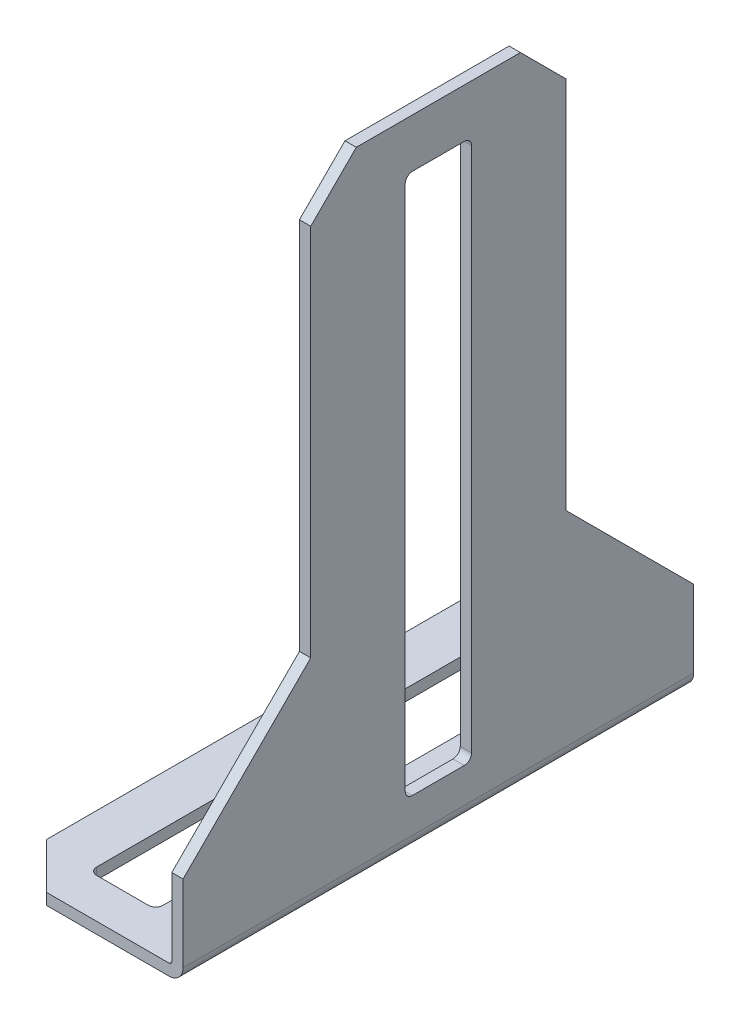
ISO-10303-21;
HEADER;
FILE_DESCRIPTION(('STEP AP214'),'2;1');
FILE_NAME('part.step','',(''),(''),'','','');
FILE_SCHEMA(('AUTOMOTIVE_DESIGN { 1 0 10303 214 1 1 1 1 }'));
ENDSEC;
DATA;
#1=APPLICATION_CONTEXT('core data for automotive mechanical design processes');
#2=APPLICATION_PROTOCOL_DEFINITION('international standard','automotive_design',2000,#1);
#3=PRODUCT_CONTEXT('',#1,'mechanical');
#4=PRODUCT('Part','Part','',(#3));
#5=PRODUCT_RELATED_PRODUCT_CATEGORY('part','',(#4));
#6=PRODUCT_DEFINITION_FORMATION('','',#4);
#7=PRODUCT_DEFINITION_CONTEXT('part definition',#1,'design');
#8=PRODUCT_DEFINITION('design','',#6,#7);
#9=PRODUCT_DEFINITION_SHAPE('','',#8);
#10=(LENGTH_UNIT() NAMED_UNIT(*) SI_UNIT(.MILLI.,.METRE.));
#11=(NAMED_UNIT(*) PLANE_ANGLE_UNIT() SI_UNIT($,.RADIAN.));
#12=(NAMED_UNIT(*) SI_UNIT($,.STERADIAN.) SOLID_ANGLE_UNIT());
#13=UNCERTAINTY_MEASURE_WITH_UNIT(LENGTH_MEASURE(1.E-05),#10,'distance_accuracy_value','');
#14=(GEOMETRIC_REPRESENTATION_CONTEXT(3) GLOBAL_UNCERTAINTY_ASSIGNED_CONTEXT((#13)) GLOBAL_UNIT_ASSIGNED_CONTEXT((#10,
#11,#12)) REPRESENTATION_CONTEXT('',''));
#15=CARTESIAN_POINT('',(0.,0.,0.));
#16=DIRECTION('',(0.,0.,1.));
#17=DIRECTION('',(1.,0.,0.));
#18=AXIS2_PLACEMENT_3D('',#15,#16,#17);
#19=CARTESIAN_POINT('',(12.7,44.45,-17.78));
#20=DIRECTION('',(0.,0.,-1.));
#21=DIRECTION('',(-1.,0.,0.));
#22=AXIS2_PLACEMENT_3D('',#19,#20,#21);
#23=PLANE('',#22);
#24=DIRECTION('',(0.,-1.,0.));
#25=VECTOR('',#24,1.);
#26=CARTESIAN_POINT('',(12.7,44.45,-17.78));
#27=LINE('',#26,#25);
#28=CARTESIAN_POINT('',(12.7,6.34999999999993,-17.78));
#29=VERTEX_POINT('',#28);
#30=CARTESIAN_POINT('',(12.7,0.990600000000001,-17.78));
#31=VERTEX_POINT('',#30);
#32=EDGE_CURVE('E246',#29,#31,#27,.T.);
#33=ORIENTED_EDGE('',*,*,#32,.T.);
#34=CARTESIAN_POINT('',(11.7094,0.990599999999999,-17.78));
#35=DIRECTION('',(0.,0.,-1.));
#36=DIRECTION('',(-1.,0.,0.));
#37=AXIS2_PLACEMENT_3D('',#34,#35,#36);
#38=CIRCLE('',#37,0.990599999999999);
#39=CARTESIAN_POINT('',(11.7094,0.,-17.78));
#40=VERTEX_POINT('',#39);
#41=EDGE_CURVE('E11',#31,#40,#38,.T.);
#42=ORIENTED_EDGE('',*,*,#41,.T.);
#43=DIRECTION('',(-1.,0.,0.));
#44=VECTOR('',#43,1.);
#45=CARTESIAN_POINT('',(12.7,0.,-17.78));
#46=LINE('',#45,#44);
#47=CARTESIAN_POINT('',(3.17500000000002,0.,-17.78));
#48=VERTEX_POINT('',#47);
#49=EDGE_CURVE('E399',#40,#48,#46,.T.);
#50=ORIENTED_EDGE('',*,*,#49,.T.);
#51=DIRECTION('',(0.,1.,0.));
#52=VECTOR('',#51,1.);
#53=CARTESIAN_POINT('',(3.17500000000002,44.45,-17.78));
#54=LINE('',#53,#52);
#55=CARTESIAN_POINT('',(3.17500000000002,0.7874,-17.78));
#56=VERTEX_POINT('',#55);
#57=EDGE_CURVE('E307',#48,#56,#54,.T.);
#58=ORIENTED_EDGE('',*,*,#57,.T.);
#59=DIRECTION('',(-1.,0.,0.));
#60=VECTOR('',#59,1.);
#61=CARTESIAN_POINT('',(11.9126,0.7874,-17.78));
#62=LINE('',#61,#60);
#63=CARTESIAN_POINT('',(11.7094,0.7874,-17.78));
#64=VERTEX_POINT('',#63);
#65=EDGE_CURVE('E457',#64,#56,#62,.T.);
#66=ORIENTED_EDGE('',*,*,#65,.F.);
#67=CARTESIAN_POINT('',(11.7094,0.990600000000001,-17.78));
#68=DIRECTION('',(0.,0.,-1.));
#69=DIRECTION('',(-1.,0.,0.));
#70=AXIS2_PLACEMENT_3D('',#67,#68,#69);
#71=CIRCLE('',#70,0.203200000000001);
#72=CARTESIAN_POINT('',(11.9126,0.990600000000015,-17.78));
#73=VERTEX_POINT('',#72);
#74=EDGE_CURVE('E315',#64,#73,#71,.F.);
#75=ORIENTED_EDGE('',*,*,#74,.T.);
#76=DIRECTION('',(0.,-1.,0.));
#77=VECTOR('',#76,1.);
#78=CARTESIAN_POINT('',(11.9126,44.45,-17.78));
#79=LINE('',#78,#77);
#80=CARTESIAN_POINT('',(11.9126,6.34999999999994,-17.78));
#81=VERTEX_POINT('',#80);
#82=EDGE_CURVE('E444',#81,#73,#79,.T.);
#83=ORIENTED_EDGE('',*,*,#82,.F.);
#84=DIRECTION('',(-1.,0.,0.));
#85=VECTOR('',#84,1.);
#86=CARTESIAN_POINT('',(0.,6.34999999999994,-17.78));
#87=LINE('',#86,#85);
#88=EDGE_CURVE('E441',#81,#29,#87,.F.);
#89=ORIENTED_EDGE('',*,*,#88,.T.);
#90=EDGE_LOOP('',(#33,#42,#50,#58,#66,#75,#83,#89));
#91=FACE_BOUND('',#90,.T.);
#92=ADVANCED_FACE('F32',(#91),#23,.T.);
#93=CARTESIAN_POINT('',(12.7,44.45,17.78));
#94=DIRECTION('',(0.,1.,0.));
#95=DIRECTION('',(0.,0.,1.));
#96=AXIS2_PLACEMENT_3D('',#93,#94,#95);
#97=PLANE('',#96);
#98=DIRECTION('',(0.,0.,-1.));
#99=VECTOR('',#98,1.);
#100=CARTESIAN_POINT('',(12.7,44.45,17.78));
#101=LINE('',#100,#99);
#102=CARTESIAN_POINT('',(12.7,44.45,5.71500000000001));
#103=VERTEX_POINT('',#102);
#104=CARTESIAN_POINT('',(12.7,44.45,-5.71499999999999));
#105=VERTEX_POINT('',#104);
#106=EDGE_CURVE('E245',#103,#105,#101,.T.);
#107=ORIENTED_EDGE('',*,*,#106,.T.);
#108=DIRECTION('',(-1.,0.,0.));
#109=VECTOR('',#108,1.);
#110=CARTESIAN_POINT('',(11.9126,44.45,-5.71499999999999));
#111=LINE('',#110,#109);
#112=CARTESIAN_POINT('',(11.9126,44.45,-5.71499999999998));
#113=VERTEX_POINT('',#112);
#114=EDGE_CURVE('E299',#105,#113,#111,.T.);
#115=ORIENTED_EDGE('',*,*,#114,.T.);
#116=DIRECTION('',(0.,0.,-1.));
#117=VECTOR('',#116,1.);
#118=CARTESIAN_POINT('',(11.9126,44.45,17.78));
#119=LINE('',#118,#117);
#120=CARTESIAN_POINT('',(11.9126,44.45,5.71500000000001));
#121=VERTEX_POINT('',#120);
#122=EDGE_CURVE('E459',#121,#113,#119,.T.);
#123=ORIENTED_EDGE('',*,*,#122,.F.);
#124=DIRECTION('',(1.,0.,0.));
#125=VECTOR('',#124,1.);
#126=CARTESIAN_POINT('',(12.7,44.45,5.71500000000001));
#127=LINE('',#126,#125);
#128=EDGE_CURVE('E296',#121,#103,#127,.T.);
#129=ORIENTED_EDGE('',*,*,#128,.T.);
#130=EDGE_LOOP('',(#107,#115,#123,#129));
#131=FACE_BOUND('',#130,.T.);
#132=ADVANCED_FACE('F475',(#131),#97,.T.);
#133=CARTESIAN_POINT('',(12.7,0.,17.78));
#134=DIRECTION('',(0.,0.,1.));
#135=DIRECTION('',(1.,0.,0.));
#136=AXIS2_PLACEMENT_3D('',#133,#134,#135);
#137=PLANE('',#136);
#138=DIRECTION('',(-1.,0.,0.));
#139=VECTOR('',#138,1.);
#140=CARTESIAN_POINT('',(12.7,0.,17.78));
#141=LINE('',#140,#139);
#142=CARTESIAN_POINT('',(11.7094,0.,17.78));
#143=VERTEX_POINT('',#142);
#144=CARTESIAN_POINT('',(3.17500000000002,0.,17.78));
#145=VERTEX_POINT('',#144);
#146=EDGE_CURVE('E398',#143,#145,#141,.T.);
#147=ORIENTED_EDGE('',*,*,#146,.F.);
#148=CARTESIAN_POINT('',(11.7094,0.990599999999999,17.78));
#149=DIRECTION('',(0.,0.,1.));
#150=DIRECTION('',(1.,0.,0.));
#151=AXIS2_PLACEMENT_3D('',#148,#149,#150);
#152=CIRCLE('',#151,0.990599999999999);
#153=CARTESIAN_POINT('',(12.7,0.990599999999999,17.78));
#154=VERTEX_POINT('',#153);
#155=EDGE_CURVE('E54',#143,#154,#152,.T.);
#156=ORIENTED_EDGE('',*,*,#155,.T.);
#157=DIRECTION('',(0.,1.,0.));
#158=VECTOR('',#157,1.);
#159=CARTESIAN_POINT('',(12.7,0.,17.78));
#160=LINE('',#159,#158);
#161=CARTESIAN_POINT('',(12.7,6.35,17.78));
#162=VERTEX_POINT('',#161);
#163=EDGE_CURVE('E238',#154,#162,#160,.T.);
#164=ORIENTED_EDGE('',*,*,#163,.T.);
#165=DIRECTION('',(1.,0.,0.));
#166=VECTOR('',#165,1.);
#167=CARTESIAN_POINT('',(0.,6.35,17.78));
#168=LINE('',#167,#166);
#169=CARTESIAN_POINT('',(11.9126,6.35,17.78));
#170=VERTEX_POINT('',#169);
#171=EDGE_CURVE('E242',#170,#162,#168,.T.);
#172=ORIENTED_EDGE('',*,*,#171,.F.);
#173=DIRECTION('',(0.,-1.,0.));
#174=VECTOR('',#173,1.);
#175=CARTESIAN_POINT('',(11.9126,44.45,17.78));
#176=LINE('',#175,#174);
#177=CARTESIAN_POINT('',(11.9126,0.990600000000015,17.78));
#178=VERTEX_POINT('',#177);
#179=EDGE_CURVE('E453',#170,#178,#176,.T.);
#180=ORIENTED_EDGE('',*,*,#179,.T.);
#181=CARTESIAN_POINT('',(11.7094,0.990600000000001,17.78));
#182=DIRECTION('',(0.,0.,1.));
#183=DIRECTION('',(1.,0.,0.));
#184=AXIS2_PLACEMENT_3D('',#181,#182,#183);
#185=CIRCLE('',#184,0.203200000000001);
#186=CARTESIAN_POINT('',(11.7094,0.7874,17.78));
#187=VERTEX_POINT('',#186);
#188=EDGE_CURVE('E317',#178,#187,#185,.F.);
#189=ORIENTED_EDGE('',*,*,#188,.T.);
#190=DIRECTION('',(-1.,0.,0.));
#191=VECTOR('',#190,1.);
#192=CARTESIAN_POINT('',(11.9126,0.7874,17.78));
#193=LINE('',#192,#191);
#194=CARTESIAN_POINT('',(3.17500000000002,0.7874,17.78));
#195=VERTEX_POINT('',#194);
#196=EDGE_CURVE('E456',#187,#195,#193,.T.);
#197=ORIENTED_EDGE('',*,*,#196,.T.);
#198=DIRECTION('',(0.,-1.,0.));
#199=VECTOR('',#198,1.);
#200=CARTESIAN_POINT('',(3.17500000000002,0.,17.78));
#201=LINE('',#200,#199);
#202=EDGE_CURVE('E281',#195,#145,#201,.T.);
#203=ORIENTED_EDGE('',*,*,#202,.T.);
#204=EDGE_LOOP('',(#147,#156,#164,#172,#180,#189,#197,#203));
#205=FACE_BOUND('',#204,.T.);
#206=ADVANCED_FACE('F240',(#205),#137,.T.);
#207=CARTESIAN_POINT('',(12.7,0.,-17.78));
#208=DIRECTION('',(0.,-1.,0.));
#209=DIRECTION('',(0.,0.,-1.));
#210=AXIS2_PLACEMENT_3D('',#207,#208,#209);
#211=PLANE('',#210);
#212=DIRECTION('',(0.,0.,1.));
#213=VECTOR('',#212,1.);
#214=CARTESIAN_POINT('',(8.0264,0.,-15.0114));
#215=LINE('',#214,#213);
#216=CARTESIAN_POINT('',(8.0264,0.,-14.5034));
#217=VERTEX_POINT('',#216);
#218=CARTESIAN_POINT('',(8.0264,0.,14.5034));
#219=VERTEX_POINT('',#218);
#220=EDGE_CURVE('E588',#217,#219,#215,.T.);
#221=ORIENTED_EDGE('',*,*,#220,.F.);
#222=CARTESIAN_POINT('',(7.5184,0.,-14.5034));
#223=DIRECTION('',(0.,-1.,0.));
#224=DIRECTION('',(0.,0.,-1.));
#225=AXIS2_PLACEMENT_3D('',#222,#223,#224);
#226=CIRCLE('',#225,0.508);
#227=CARTESIAN_POINT('',(7.5184,0.,-15.0114));
#228=VERTEX_POINT('',#227);
#229=EDGE_CURVE('E383',#217,#228,#226,.F.);
#230=ORIENTED_EDGE('',*,*,#229,.T.);
#231=DIRECTION('',(1.,0.,0.));
#232=VECTOR('',#231,1.);
#233=CARTESIAN_POINT('',(3.4036,0.,-15.0114));
#234=LINE('',#233,#232);
#235=CARTESIAN_POINT('',(3.9116,0.,-15.0114));
#236=VERTEX_POINT('',#235);
#237=EDGE_CURVE('E260',#236,#228,#234,.T.);
#238=ORIENTED_EDGE('',*,*,#237,.F.);
#239=CARTESIAN_POINT('',(3.9116,0.,-14.5034));
#240=DIRECTION('',(0.,-1.,0.));
#241=DIRECTION('',(0.,0.,-1.));
#242=AXIS2_PLACEMENT_3D('',#239,#240,#241);
#243=CIRCLE('',#242,0.508);
#244=CARTESIAN_POINT('',(3.4036,0.,-14.5034));
#245=VERTEX_POINT('',#244);
#246=EDGE_CURVE('E375',#236,#245,#243,.F.);
#247=ORIENTED_EDGE('',*,*,#246,.T.);
#248=DIRECTION('',(0.,0.,-1.));
#249=VECTOR('',#248,1.);
#250=CARTESIAN_POINT('',(3.4036,0.,15.0114));
#251=LINE('',#250,#249);
#252=CARTESIAN_POINT('',(3.4036,0.,14.5034));
#253=VERTEX_POINT('',#252);
#254=EDGE_CURVE('E264',#253,#245,#251,.T.);
#255=ORIENTED_EDGE('',*,*,#254,.F.);
#256=CARTESIAN_POINT('',(3.9116,0.,14.5034));
#257=DIRECTION('',(0.,-1.,0.));
#258=DIRECTION('',(0.,0.,-1.));
#259=AXIS2_PLACEMENT_3D('',#256,#257,#258);
#260=CIRCLE('',#259,0.508);
#261=CARTESIAN_POINT('',(3.9116,0.,15.0114));
#262=VERTEX_POINT('',#261);
#263=EDGE_CURVE('E371',#253,#262,#260,.F.);
#264=ORIENTED_EDGE('',*,*,#263,.T.);
#265=DIRECTION('',(-1.,0.,0.));
#266=VECTOR('',#265,1.);
#267=CARTESIAN_POINT('',(8.0264,0.,15.0114));
#268=LINE('',#267,#266);
#269=CARTESIAN_POINT('',(7.5184,0.,15.0114));
#270=VERTEX_POINT('',#269);
#271=EDGE_CURVE('E597',#270,#262,#268,.T.);
#272=ORIENTED_EDGE('',*,*,#271,.F.);
#273=CARTESIAN_POINT('',(7.5184,0.,14.5034));
#274=DIRECTION('',(0.,-1.,0.));
#275=DIRECTION('',(0.,0.,-1.));
#276=AXIS2_PLACEMENT_3D('',#273,#274,#275);
#277=CIRCLE('',#276,0.508);
#278=EDGE_CURVE('E387',#270,#219,#277,.F.);
#279=ORIENTED_EDGE('',*,*,#278,.T.);
#280=EDGE_LOOP('',(#221,#230,#238,#247,#255,#264,#272,#279));
#281=FACE_BOUND('',#280,.T.);
#282=ORIENTED_EDGE('',*,*,#49,.F.);
#283=DIRECTION('',(0.,0.,1.));
#284=VECTOR('',#283,1.);
#285=CARTESIAN_POINT('',(11.7094,0.,17.78));
#286=LINE('',#285,#284);
#287=EDGE_CURVE('E391',#40,#143,#286,.T.);
#288=ORIENTED_EDGE('',*,*,#287,.T.);
#289=ORIENTED_EDGE('',*,*,#146,.T.);
#290=DIRECTION('',(0.70710678118655,0.,0.707106781186545));
#291=VECTOR('',#290,1.);
#292=CARTESIAN_POINT('',(-9.84249999999996,0.,4.76250000000011));
#293=LINE('',#292,#291);
#294=CARTESIAN_POINT('',(0.,0.,14.605));
#295=VERTEX_POINT('',#294);
#296=EDGE_CURVE('E287',#145,#295,#293,.F.);
#297=ORIENTED_EDGE('',*,*,#296,.T.);
#298=DIRECTION('',(0.,0.,1.));
#299=VECTOR('',#298,1.);
#300=CARTESIAN_POINT('',(0.,0.,-17.78));
#301=LINE('',#300,#299);
#302=CARTESIAN_POINT('',(0.,0.,-14.605));
#303=VERTEX_POINT('',#302);
#304=EDGE_CURVE('E410',#303,#295,#301,.T.);
#305=ORIENTED_EDGE('',*,*,#304,.F.);
#306=DIRECTION('',(-0.70710678118655,0.,0.707106781186545));
#307=VECTOR('',#306,1.);
#308=CARTESIAN_POINT('',(7.93750000000004,0.,-22.5425));
#309=LINE('',#308,#307);
#310=EDGE_CURVE('E284',#303,#48,#309,.F.);
#311=ORIENTED_EDGE('',*,*,#310,.T.);
#312=EDGE_LOOP('',(#282,#288,#289,#297,#305,#311));
#313=FACE_BOUND('',#312,.T.);
#314=ADVANCED_FACE('F397',(#281,#313),#211,.T.);
#315=CARTESIAN_POINT('',(12.7,0.,0.));
#316=DIRECTION('',(-1.,0.,0.));
#317=DIRECTION('',(0.,0.,1.));
#318=AXIS2_PLACEMENT_3D('',#315,#316,#317);
#319=PLANE('',#318);
#320=DIRECTION('',(0.,-1.,0.));
#321=VECTOR('',#320,1.);
#322=CARTESIAN_POINT('',(12.7,41.0464,2.3114));
#323=LINE('',#322,#321);
#324=CARTESIAN_POINT('',(12.7,40.5384,2.3114));
#325=VERTEX_POINT('',#324);
#326=CARTESIAN_POINT('',(12.7,3.9116,2.3114));
#327=VERTEX_POINT('',#326);
#328=EDGE_CURVE('E856',#325,#327,#323,.T.);
#329=ORIENTED_EDGE('',*,*,#328,.F.);
#330=CARTESIAN_POINT('',(12.7,40.5384,1.8034));
#331=DIRECTION('',(-1.,0.,0.));
#332=DIRECTION('',(0.,0.,1.));
#333=AXIS2_PLACEMENT_3D('',#330,#331,#332);
#334=CIRCLE('',#333,0.508);
#335=CARTESIAN_POINT('',(12.7,41.0464,1.8034));
#336=VERTEX_POINT('',#335);
#337=EDGE_CURVE('E363',#325,#336,#334,.T.);
#338=ORIENTED_EDGE('',*,*,#337,.T.);
#339=DIRECTION('',(0.,0.,1.));
#340=VECTOR('',#339,1.);
#341=CARTESIAN_POINT('',(12.7,41.0464,-2.3114));
#342=LINE('',#341,#340);
#343=CARTESIAN_POINT('',(12.7,41.0464,-1.8034));
#344=VERTEX_POINT('',#343);
#345=EDGE_CURVE('E855',#344,#336,#342,.T.);
#346=ORIENTED_EDGE('',*,*,#345,.F.);
#347=CARTESIAN_POINT('',(12.7,40.5384,-1.8034));
#348=DIRECTION('',(-1.,0.,0.));
#349=DIRECTION('',(0.,0.,1.));
#350=AXIS2_PLACEMENT_3D('',#347,#348,#349);
#351=CIRCLE('',#350,0.508);
#352=CARTESIAN_POINT('',(12.7,40.5384,-2.3114));
#353=VERTEX_POINT('',#352);
#354=EDGE_CURVE('E379',#344,#353,#351,.T.);
#355=ORIENTED_EDGE('',*,*,#354,.T.);
#356=DIRECTION('',(0.,1.,0.));
#357=VECTOR('',#356,1.);
#358=CARTESIAN_POINT('',(12.7,3.4036,-2.3114));
#359=LINE('',#358,#357);
#360=CARTESIAN_POINT('',(12.7,3.9116,-2.3114));
#361=VERTEX_POINT('',#360);
#362=EDGE_CURVE('E611',#361,#353,#359,.T.);
#363=ORIENTED_EDGE('',*,*,#362,.F.);
#364=CARTESIAN_POINT('',(12.7,3.9116,-1.8034));
#365=DIRECTION('',(-1.,0.,0.));
#366=DIRECTION('',(0.,0.,1.));
#367=AXIS2_PLACEMENT_3D('',#364,#365,#366);
#368=CIRCLE('',#367,0.508);
#369=CARTESIAN_POINT('',(12.7,3.4036,-1.8034));
#370=VERTEX_POINT('',#369);
#371=EDGE_CURVE('E359',#361,#370,#368,.T.);
#372=ORIENTED_EDGE('',*,*,#371,.T.);
#373=DIRECTION('',(0.,0.,-1.));
#374=VECTOR('',#373,1.);
#375=CARTESIAN_POINT('',(12.7,3.4036,2.3114));
#376=LINE('',#375,#374);
#377=CARTESIAN_POINT('',(12.7,3.4036,1.8034));
#378=VERTEX_POINT('',#377);
#379=EDGE_CURVE('E615',#378,#370,#376,.T.);
#380=ORIENTED_EDGE('',*,*,#379,.F.);
#381=CARTESIAN_POINT('',(12.7,3.9116,1.8034));
#382=DIRECTION('',(-1.,0.,0.));
#383=DIRECTION('',(0.,0.,1.));
#384=AXIS2_PLACEMENT_3D('',#381,#382,#383);
#385=CIRCLE('',#384,0.508);
#386=EDGE_CURVE('E367',#378,#327,#385,.T.);
#387=ORIENTED_EDGE('',*,*,#386,.T.);
#388=EDGE_LOOP('',(#329,#338,#346,#355,#363,#372,#380,#387));
#389=FACE_BOUND('',#388,.T.);
#390=ORIENTED_EDGE('',*,*,#163,.F.);
#391=DIRECTION('',(0.,0.,1.));
#392=VECTOR('',#391,1.);
#393=CARTESIAN_POINT('',(12.7,0.990599999999999,-17.78));
#394=LINE('',#393,#392);
#395=EDGE_CURVE('E40',#154,#31,#394,.F.);
#396=ORIENTED_EDGE('',*,*,#395,.T.);
#397=ORIENTED_EDGE('',*,*,#32,.F.);
#398=DIRECTION('',(0.,0.70710678118655,0.707106781186545));
#399=VECTOR('',#398,1.);
#400=CARTESIAN_POINT('',(12.7,15.24,-8.89));
#401=LINE('',#400,#399);
#402=CARTESIAN_POINT('',(12.7,15.24,-8.89));
#403=VERTEX_POINT('',#402);
#404=EDGE_CURVE('E446',#403,#29,#401,.F.);
#405=ORIENTED_EDGE('',*,*,#404,.F.);
#406=DIRECTION('',(0.,-1.,0.));
#407=VECTOR('',#406,1.);
#408=CARTESIAN_POINT('',(12.7,44.45,-8.89));
#409=LINE('',#408,#407);
#410=CARTESIAN_POINT('',(12.7,41.275,-8.89));
#411=VERTEX_POINT('',#410);
#412=EDGE_CURVE('E447',#411,#403,#409,.T.);
#413=ORIENTED_EDGE('',*,*,#412,.F.);
#414=DIRECTION('',(0.,0.707106781186544,0.707106781186551));
#415=VECTOR('',#414,1.);
#416=CARTESIAN_POINT('',(12.7,41.275,-8.89));
#417=LINE('',#416,#415);
#418=EDGE_CURVE('E294',#411,#105,#417,.T.);
#419=ORIENTED_EDGE('',*,*,#418,.T.);
#420=ORIENTED_EDGE('',*,*,#106,.F.);
#421=DIRECTION('',(0.,-0.70710678118655,0.707106781186545));
#422=VECTOR('',#421,1.);
#423=CARTESIAN_POINT('',(12.7,44.45,5.71500000000001));
#424=LINE('',#423,#422);
#425=CARTESIAN_POINT('',(12.7,41.275,8.89));
#426=VERTEX_POINT('',#425);
#427=EDGE_CURVE('E292',#103,#426,#424,.T.);
#428=ORIENTED_EDGE('',*,*,#427,.T.);
#429=DIRECTION('',(0.,1.,0.));
#430=VECTOR('',#429,1.);
#431=CARTESIAN_POINT('',(12.7,6.35,8.89));
#432=LINE('',#431,#430);
#433=CARTESIAN_POINT('',(12.7,15.2400000000001,8.89));
#434=VERTEX_POINT('',#433);
#435=EDGE_CURVE('E256',#434,#426,#432,.T.);
#436=ORIENTED_EDGE('',*,*,#435,.F.);
#437=DIRECTION('',(0.,-0.70710678118655,0.707106781186545));
#438=VECTOR('',#437,1.);
#439=CARTESIAN_POINT('',(12.7,6.35,17.78));
#440=LINE('',#439,#438);
#441=EDGE_CURVE('E251',#162,#434,#440,.F.);
#442=ORIENTED_EDGE('',*,*,#441,.F.);
#443=EDGE_LOOP('',(#390,#396,#397,#405,#413,#419,#420,#428,#436,#442));
#444=FACE_BOUND('',#443,.T.);
#445=ADVANCED_FACE('F258',(#389,#444),#319,.F.);
#446=CARTESIAN_POINT('',(0.,0.,0.));
#447=DIRECTION('',(-1.,0.,0.));
#448=DIRECTION('',(0.,0.,1.));
#449=AXIS2_PLACEMENT_3D('',#446,#447,#448);
#450=PLANE('',#449);
#451=ORIENTED_EDGE('',*,*,#304,.T.);
#452=DIRECTION('',(0.,1.,0.));
#453=VECTOR('',#452,1.);
#454=CARTESIAN_POINT('',(0.,0.,14.605));
#455=LINE('',#454,#453);
#456=CARTESIAN_POINT('',(0.,0.7874,14.605));
#457=VERTEX_POINT('',#456);
#458=EDGE_CURVE('E272',#295,#457,#455,.T.);
#459=ORIENTED_EDGE('',*,*,#458,.T.);
#460=DIRECTION('',(0.,0.,-1.));
#461=VECTOR('',#460,1.);
#462=CARTESIAN_POINT('',(0.,0.7874,17.78));
#463=LINE('',#462,#461);
#464=CARTESIAN_POINT('',(0.,0.7874,-14.605));
#465=VERTEX_POINT('',#464);
#466=EDGE_CURVE('E466',#457,#465,#463,.T.);
#467=ORIENTED_EDGE('',*,*,#466,.T.);
#468=DIRECTION('',(0.,-1.,0.));
#469=VECTOR('',#468,1.);
#470=CARTESIAN_POINT('',(0.,0.,-14.605));
#471=LINE('',#470,#469);
#472=EDGE_CURVE('E269',#465,#303,#471,.T.);
#473=ORIENTED_EDGE('',*,*,#472,.T.);
#474=EDGE_LOOP('',(#451,#459,#467,#473));
#475=FACE_BOUND('',#474,.T.);
#476=ADVANCED_FACE('F508',(#475),#450,.T.);
#477=CARTESIAN_POINT('',(11.9126,0.7874,17.78));
#478=DIRECTION('',(0.,-1.,0.));
#479=DIRECTION('',(0.,0.,-1.));
#480=AXIS2_PLACEMENT_3D('',#477,#478,#479);
#481=PLANE('',#480);
#482=DIRECTION('',(0.,0.,-1.));
#483=VECTOR('',#482,1.);
#484=CARTESIAN_POINT('',(3.4036,0.7874,17.78));
#485=LINE('',#484,#483);
#486=CARTESIAN_POINT('',(3.4036,0.7874,14.5034));
#487=VERTEX_POINT('',#486);
#488=CARTESIAN_POINT('',(3.4036,0.7874,-14.5034));
#489=VERTEX_POINT('',#488);
#490=EDGE_CURVE('E419',#487,#489,#485,.T.);
#491=ORIENTED_EDGE('',*,*,#490,.T.);
#492=CARTESIAN_POINT('',(3.9116,0.787400000000001,-14.5034));
#493=DIRECTION('',(0.,-1.,0.));
#494=DIRECTION('',(0.,0.,-1.));
#495=AXIS2_PLACEMENT_3D('',#492,#493,#494);
#496=CIRCLE('',#495,0.508);
#497=CARTESIAN_POINT('',(3.9116,0.7874,-15.0114));
#498=VERTEX_POINT('',#497);
#499=EDGE_CURVE('E377',#489,#498,#496,.T.);
#500=ORIENTED_EDGE('',*,*,#499,.T.);
#501=DIRECTION('',(1.,0.,0.));
#502=VECTOR('',#501,1.);
#503=CARTESIAN_POINT('',(11.9126,0.7874,-15.0114));
#504=LINE('',#503,#502);
#505=CARTESIAN_POINT('',(7.5184,0.7874,-15.0114));
#506=VERTEX_POINT('',#505);
#507=EDGE_CURVE('E422',#498,#506,#504,.T.);
#508=ORIENTED_EDGE('',*,*,#507,.T.);
#509=CARTESIAN_POINT('',(7.5184,0.787400000000001,-14.5034));
#510=DIRECTION('',(0.,-1.,0.));
#511=DIRECTION('',(0.,0.,-1.));
#512=AXIS2_PLACEMENT_3D('',#509,#510,#511);
#513=CIRCLE('',#512,0.508);
#514=CARTESIAN_POINT('',(8.0264,0.7874,-14.5034));
#515=VERTEX_POINT('',#514);
#516=EDGE_CURVE('E385',#506,#515,#513,.T.);
#517=ORIENTED_EDGE('',*,*,#516,.T.);
#518=DIRECTION('',(0.,0.,1.));
#519=VECTOR('',#518,1.);
#520=CARTESIAN_POINT('',(8.0264,0.7874,17.78));
#521=LINE('',#520,#519);
#522=CARTESIAN_POINT('',(8.0264,0.7874,14.5034));
#523=VERTEX_POINT('',#522);
#524=EDGE_CURVE('E425',#515,#523,#521,.T.);
#525=ORIENTED_EDGE('',*,*,#524,.T.);
#526=CARTESIAN_POINT('',(7.5184,0.787400000000001,14.5034));
#527=DIRECTION('',(0.,-1.,0.));
#528=DIRECTION('',(0.,0.,-1.));
#529=AXIS2_PLACEMENT_3D('',#526,#527,#528);
#530=CIRCLE('',#529,0.508);
#531=CARTESIAN_POINT('',(7.5184,0.7874,15.0114));
#532=VERTEX_POINT('',#531);
#533=EDGE_CURVE('E389',#523,#532,#530,.T.);
#534=ORIENTED_EDGE('',*,*,#533,.T.);
#535=DIRECTION('',(-1.,0.,0.));
#536=VECTOR('',#535,1.);
#537=CARTESIAN_POINT('',(11.9126,0.7874,15.0114));
#538=LINE('',#537,#536);
#539=CARTESIAN_POINT('',(3.9116,0.7874,15.0114));
#540=VERTEX_POINT('',#539);
#541=EDGE_CURVE('E416',#532,#540,#538,.T.);
#542=ORIENTED_EDGE('',*,*,#541,.T.);
#543=CARTESIAN_POINT('',(3.9116,0.787400000000001,14.5034));
#544=DIRECTION('',(0.,-1.,0.));
#545=DIRECTION('',(0.,0.,-1.));
#546=AXIS2_PLACEMENT_3D('',#543,#544,#545);
#547=CIRCLE('',#546,0.508);
#548=EDGE_CURVE('E373',#540,#487,#547,.T.);
#549=ORIENTED_EDGE('',*,*,#548,.T.);
#550=EDGE_LOOP('',(#491,#500,#508,#517,#525,#534,#542,#549));
#551=FACE_BOUND('',#550,.T.);
#552=ORIENTED_EDGE('',*,*,#196,.F.);
#553=DIRECTION('',(0.,0.,-1.));
#554=VECTOR('',#553,1.);
#555=CARTESIAN_POINT('',(11.7094,0.7874,-17.78));
#556=LINE('',#555,#554);
#557=EDGE_CURVE('E310',#187,#64,#556,.T.);
#558=ORIENTED_EDGE('',*,*,#557,.T.);
#559=ORIENTED_EDGE('',*,*,#65,.T.);
#560=DIRECTION('',(0.70710678118655,0.,-0.707106781186545));
#561=VECTOR('',#560,1.);
#562=CARTESIAN_POINT('',(0.,0.7874,-14.605));
#563=LINE('',#562,#561);
#564=EDGE_CURVE('E276',#56,#465,#563,.F.);
#565=ORIENTED_EDGE('',*,*,#564,.T.);
#566=ORIENTED_EDGE('',*,*,#466,.F.);
#567=DIRECTION('',(-0.70710678118655,0.,-0.707106781186545));
#568=VECTOR('',#567,1.);
#569=CARTESIAN_POINT('',(0.,0.7874,14.605));
#570=LINE('',#569,#568);
#571=EDGE_CURVE('E278',#457,#195,#570,.F.);
#572=ORIENTED_EDGE('',*,*,#571,.T.);
#573=EDGE_LOOP('',(#552,#558,#559,#565,#566,#572));
#574=FACE_BOUND('',#573,.T.);
#575=ADVANCED_FACE('F500',(#551,#574),#481,.F.);
#576=CARTESIAN_POINT('',(11.9126,44.45,17.78));
#577=DIRECTION('',(1.,0.,0.));
#578=DIRECTION('',(0.,0.,-1.));
#579=AXIS2_PLACEMENT_3D('',#576,#577,#578);
#580=PLANE('',#579);
#581=DIRECTION('',(0.,0.,-1.));
#582=VECTOR('',#581,1.);
#583=CARTESIAN_POINT('',(11.9126,3.4036,17.78));
#584=LINE('',#583,#582);
#585=CARTESIAN_POINT('',(11.9126,3.4036,1.8034));
#586=VERTEX_POINT('',#585);
#587=CARTESIAN_POINT('',(11.9126,3.4036,-1.8034));
#588=VERTEX_POINT('',#587);
#589=EDGE_CURVE('E431',#586,#588,#584,.T.);
#590=ORIENTED_EDGE('',*,*,#589,.T.);
#591=CARTESIAN_POINT('',(11.9126,3.9116,-1.8034));
#592=DIRECTION('',(1.,0.,0.));
#593=DIRECTION('',(0.,0.,-1.));
#594=AXIS2_PLACEMENT_3D('',#591,#592,#593);
#595=CIRCLE('',#594,0.508);
#596=CARTESIAN_POINT('',(11.9126,3.9116,-2.3114));
#597=VERTEX_POINT('',#596);
#598=EDGE_CURVE('E361',#588,#597,#595,.T.);
#599=ORIENTED_EDGE('',*,*,#598,.T.);
#600=DIRECTION('',(0.,1.,0.));
#601=VECTOR('',#600,1.);
#602=CARTESIAN_POINT('',(11.9126,44.45,-2.3114));
#603=LINE('',#602,#601);
#604=CARTESIAN_POINT('',(11.9126,40.5384,-2.3114));
#605=VERTEX_POINT('',#604);
#606=EDGE_CURVE('E434',#597,#605,#603,.T.);
#607=ORIENTED_EDGE('',*,*,#606,.T.);
#608=CARTESIAN_POINT('',(11.9126,40.5384,-1.8034));
#609=DIRECTION('',(1.,0.,0.));
#610=DIRECTION('',(0.,0.,-1.));
#611=AXIS2_PLACEMENT_3D('',#608,#609,#610);
#612=CIRCLE('',#611,0.508);
#613=CARTESIAN_POINT('',(11.9126,41.0464,-1.8034));
#614=VERTEX_POINT('',#613);
#615=EDGE_CURVE('E381',#605,#614,#612,.T.);
#616=ORIENTED_EDGE('',*,*,#615,.T.);
#617=DIRECTION('',(0.,0.,1.));
#618=VECTOR('',#617,1.);
#619=CARTESIAN_POINT('',(11.9126,41.0464,17.78));
#620=LINE('',#619,#618);
#621=CARTESIAN_POINT('',(11.9126,41.0464,1.8034));
#622=VERTEX_POINT('',#621);
#623=EDGE_CURVE('E273',#614,#622,#620,.T.);
#624=ORIENTED_EDGE('',*,*,#623,.T.);
#625=CARTESIAN_POINT('',(11.9126,40.5384,1.8034));
#626=DIRECTION('',(1.,0.,0.));
#627=DIRECTION('',(0.,0.,-1.));
#628=AXIS2_PLACEMENT_3D('',#625,#626,#627);
#629=CIRCLE('',#628,0.508);
#630=CARTESIAN_POINT('',(11.9126,40.5384,2.3114));
#631=VERTEX_POINT('',#630);
#632=EDGE_CURVE('E365',#622,#631,#629,.T.);
#633=ORIENTED_EDGE('',*,*,#632,.T.);
#634=DIRECTION('',(0.,-1.,0.));
#635=VECTOR('',#634,1.);
#636=CARTESIAN_POINT('',(11.9126,44.45,2.3114));
#637=LINE('',#636,#635);
#638=CARTESIAN_POINT('',(11.9126,3.9116,2.3114));
#639=VERTEX_POINT('',#638);
#640=EDGE_CURVE('E428',#631,#639,#637,.T.);
#641=ORIENTED_EDGE('',*,*,#640,.T.);
#642=CARTESIAN_POINT('',(11.9126,3.9116,1.8034));
#643=DIRECTION('',(1.,0.,0.));
#644=DIRECTION('',(0.,0.,-1.));
#645=AXIS2_PLACEMENT_3D('',#642,#643,#644);
#646=CIRCLE('',#645,0.508);
#647=EDGE_CURVE('E369',#639,#586,#646,.T.);
#648=ORIENTED_EDGE('',*,*,#647,.T.);
#649=EDGE_LOOP('',(#590,#599,#607,#616,#624,#633,#641,#648));
#650=FACE_BOUND('',#649,.T.);
#651=ORIENTED_EDGE('',*,*,#82,.T.);
#652=DIRECTION('',(0.,0.,-1.));
#653=VECTOR('',#652,1.);
#654=CARTESIAN_POINT('',(11.9126,0.990600000000001,17.78));
#655=LINE('',#654,#653);
#656=EDGE_CURVE('E313',#73,#178,#655,.F.);
#657=ORIENTED_EDGE('',*,*,#656,.T.);
#658=ORIENTED_EDGE('',*,*,#179,.F.);
#659=DIRECTION('',(0.,-0.70710678118655,0.707106781186545));
#660=VECTOR('',#659,1.);
#661=CARTESIAN_POINT('',(11.9126,25.4000000000001,-1.27));
#662=LINE('',#661,#660);
#663=CARTESIAN_POINT('',(11.9126,15.2400000000001,8.89));
#664=VERTEX_POINT('',#663);
#665=EDGE_CURVE('E254',#170,#664,#662,.F.);
#666=ORIENTED_EDGE('',*,*,#665,.T.);
#667=DIRECTION('',(0.,1.,0.));
#668=VECTOR('',#667,1.);
#669=CARTESIAN_POINT('',(11.9126,44.45,8.89));
#670=LINE('',#669,#668);
#671=CARTESIAN_POINT('',(11.9126,41.275,8.89));
#672=VERTEX_POINT('',#671);
#673=EDGE_CURVE('E413',#664,#672,#670,.T.);
#674=ORIENTED_EDGE('',*,*,#673,.T.);
#675=DIRECTION('',(0.,0.70710678118655,-0.707106781186545));
#676=VECTOR('',#675,1.);
#677=CARTESIAN_POINT('',(11.9126,44.45,5.71500000000001));
#678=LINE('',#677,#676);
#679=EDGE_CURVE('E301',#672,#121,#678,.T.);
#680=ORIENTED_EDGE('',*,*,#679,.T.);
#681=ORIENTED_EDGE('',*,*,#122,.T.);
#682=DIRECTION('',(0.,-0.707106781186544,-0.707106781186551));
#683=VECTOR('',#682,1.);
#684=CARTESIAN_POINT('',(11.9126,41.275,-8.89));
#685=LINE('',#684,#683);
#686=CARTESIAN_POINT('',(11.9126,41.275,-8.89));
#687=VERTEX_POINT('',#686);
#688=EDGE_CURVE('E303',#113,#687,#685,.T.);
#689=ORIENTED_EDGE('',*,*,#688,.T.);
#690=DIRECTION('',(0.,-1.,0.));
#691=VECTOR('',#690,1.);
#692=CARTESIAN_POINT('',(11.9126,44.45,-8.89));
#693=LINE('',#692,#691);
#694=CARTESIAN_POINT('',(11.9126,15.24,-8.89));
#695=VERTEX_POINT('',#694);
#696=EDGE_CURVE('E404',#687,#695,#693,.T.);
#697=ORIENTED_EDGE('',*,*,#696,.T.);
#698=DIRECTION('',(0.,0.70710678118655,0.707106781186545));
#699=VECTOR('',#698,1.);
#700=CARTESIAN_POINT('',(11.9126,43.1800000000001,19.0499999999999));
#701=LINE('',#700,#699);
#702=EDGE_CURVE('E406',#695,#81,#701,.F.);
#703=ORIENTED_EDGE('',*,*,#702,.T.);
#704=EDGE_LOOP('',(#651,#657,#658,#666,#674,#680,#681,#689,#697,#703));
#705=FACE_BOUND('',#704,.T.);
#706=ADVANCED_FACE('F450',(#650,#705),#580,.F.);
#707=CARTESIAN_POINT('',(0.,15.24,-8.89));
#708=DIRECTION('',(0.,0.707106781186545,-0.70710678118655));
#709=DIRECTION('',(0.,0.70710678118655,0.707106781186545));
#710=AXIS2_PLACEMENT_3D('',#707,#708,#709);
#711=PLANE('',#710);
#712=DIRECTION('',(1.,0.,0.));
#713=VECTOR('',#712,1.);
#714=CARTESIAN_POINT('',(0.,15.24,-8.89));
#715=LINE('',#714,#713);
#716=EDGE_CURVE('E445',#695,#403,#715,.T.);
#717=ORIENTED_EDGE('',*,*,#716,.T.);
#718=ORIENTED_EDGE('',*,*,#404,.T.);
#719=ORIENTED_EDGE('',*,*,#88,.F.);
#720=ORIENTED_EDGE('',*,*,#702,.F.);
#721=EDGE_LOOP('',(#717,#718,#719,#720));
#722=FACE_BOUND('',#721,.T.);
#723=ADVANCED_FACE('F491',(#722),#711,.T.);
#724=CARTESIAN_POINT('',(0.,44.45,-8.89));
#725=DIRECTION('',(0.,0.,1.));
#726=DIRECTION('',(1.,0.,0.));
#727=AXIS2_PLACEMENT_3D('',#724,#725,#726);
#728=PLANE('',#727);
#729=ORIENTED_EDGE('',*,*,#696,.F.);
#730=DIRECTION('',(1.,0.,0.));
#731=VECTOR('',#730,1.);
#732=CARTESIAN_POINT('',(12.7,41.275,-8.89));
#733=LINE('',#732,#731);
#734=EDGE_CURVE('E289',#687,#411,#733,.T.);
#735=ORIENTED_EDGE('',*,*,#734,.T.);
#736=ORIENTED_EDGE('',*,*,#412,.T.);
#737=ORIENTED_EDGE('',*,*,#716,.F.);
#738=EDGE_LOOP('',(#729,#735,#736,#737));
#739=FACE_BOUND('',#738,.T.);
#740=ADVANCED_FACE('F485',(#739),#728,.F.);
#741=CARTESIAN_POINT('',(0.,6.35,8.89));
#742=DIRECTION('',(0.,0.,-1.));
#743=DIRECTION('',(0.,1.,0.));
#744=AXIS2_PLACEMENT_3D('',#741,#742,#743);
#745=PLANE('',#744);
#746=ORIENTED_EDGE('',*,*,#435,.T.);
#747=DIRECTION('',(-1.,0.,0.));
#748=VECTOR('',#747,1.);
#749=CARTESIAN_POINT('',(11.9126,41.275,8.89));
#750=LINE('',#749,#748);
#751=EDGE_CURVE('E305',#426,#672,#750,.T.);
#752=ORIENTED_EDGE('',*,*,#751,.T.);
#753=ORIENTED_EDGE('',*,*,#673,.F.);
#754=DIRECTION('',(-1.,0.,0.));
#755=VECTOR('',#754,1.);
#756=CARTESIAN_POINT('',(0.,15.2400000000001,8.89));
#757=LINE('',#756,#755);
#758=EDGE_CURVE('E255',#664,#434,#757,.F.);
#759=ORIENTED_EDGE('',*,*,#758,.T.);
#760=EDGE_LOOP('',(#746,#752,#753,#759));
#761=FACE_BOUND('',#760,.T.);
#762=ADVANCED_FACE('F535',(#761),#745,.F.);
#763=CARTESIAN_POINT('',(0.,6.35,17.78));
#764=DIRECTION('',(0.,0.707106781186545,0.70710678118655));
#765=DIRECTION('',(0.,-0.70710678118655,0.707106781186545));
#766=AXIS2_PLACEMENT_3D('',#763,#764,#765);
#767=PLANE('',#766);
#768=ORIENTED_EDGE('',*,*,#171,.T.);
#769=ORIENTED_EDGE('',*,*,#441,.T.);
#770=ORIENTED_EDGE('',*,*,#758,.F.);
#771=ORIENTED_EDGE('',*,*,#665,.F.);
#772=EDGE_LOOP('',(#768,#769,#770,#771));
#773=FACE_BOUND('',#772,.T.);
#774=ADVANCED_FACE('F250',(#773),#767,.T.);
#775=CARTESIAN_POINT('',(8.0264,44.45,-15.0114));
#776=DIRECTION('',(1.,0.,0.));
#777=DIRECTION('',(0.,0.,-1.));
#778=AXIS2_PLACEMENT_3D('',#775,#776,#777);
#779=PLANE('',#778);
#780=ORIENTED_EDGE('',*,*,#524,.F.);
#781=DIRECTION('',(0.,-1.,0.));
#782=VECTOR('',#781,1.);
#783=CARTESIAN_POINT('',(8.0264,0.,-14.5034));
#784=LINE('',#783,#782);
#785=EDGE_CURVE('E356',#515,#217,#784,.T.);
#786=ORIENTED_EDGE('',*,*,#785,.T.);
#787=ORIENTED_EDGE('',*,*,#220,.T.);
#788=DIRECTION('',(0.,-1.,0.));
#789=VECTOR('',#788,1.);
#790=CARTESIAN_POINT('',(8.0264,0.787400000000001,14.5034));
#791=LINE('',#790,#789);
#792=EDGE_CURVE('E354',#219,#523,#791,.F.);
#793=ORIENTED_EDGE('',*,*,#792,.T.);
#794=EDGE_LOOP('',(#780,#786,#787,#793));
#795=FACE_BOUND('',#794,.T.);
#796=ADVANCED_FACE('F534',(#795),#779,.F.);
#797=CARTESIAN_POINT('',(3.4036,44.45,-15.0114));
#798=DIRECTION('',(0.,0.,-1.));
#799=DIRECTION('',(-1.,0.,0.));
#800=AXIS2_PLACEMENT_3D('',#797,#798,#799);
#801=PLANE('',#800);
#802=ORIENTED_EDGE('',*,*,#507,.F.);
#803=DIRECTION('',(0.,-1.,0.));
#804=VECTOR('',#803,1.);
#805=CARTESIAN_POINT('',(3.9116,0.,-15.0114));
#806=LINE('',#805,#804);
#807=EDGE_CURVE('E351',#498,#236,#806,.T.);
#808=ORIENTED_EDGE('',*,*,#807,.T.);
#809=ORIENTED_EDGE('',*,*,#237,.T.);
#810=DIRECTION('',(0.,-1.,0.));
#811=VECTOR('',#810,1.);
#812=CARTESIAN_POINT('',(7.5184,0.787400000000001,-15.0114));
#813=LINE('',#812,#811);
#814=EDGE_CURVE('E349',#228,#506,#813,.F.);
#815=ORIENTED_EDGE('',*,*,#814,.T.);
#816=EDGE_LOOP('',(#802,#808,#809,#815));
#817=FACE_BOUND('',#816,.T.);
#818=ADVANCED_FACE('F608',(#817),#801,.F.);
#819=CARTESIAN_POINT('',(3.4036,44.45,15.0114));
#820=DIRECTION('',(-1.,0.,0.));
#821=DIRECTION('',(0.,0.,1.));
#822=AXIS2_PLACEMENT_3D('',#819,#820,#821);
#823=PLANE('',#822);
#824=ORIENTED_EDGE('',*,*,#490,.F.);
#825=DIRECTION('',(0.,-1.,0.));
#826=VECTOR('',#825,1.);
#827=CARTESIAN_POINT('',(3.4036,0.,14.5034));
#828=LINE('',#827,#826);
#829=EDGE_CURVE('E341',#487,#253,#828,.T.);
#830=ORIENTED_EDGE('',*,*,#829,.T.);
#831=ORIENTED_EDGE('',*,*,#254,.T.);
#832=DIRECTION('',(0.,-1.,0.));
#833=VECTOR('',#832,1.);
#834=CARTESIAN_POINT('',(3.4036,0.787400000000001,-14.5034));
#835=LINE('',#834,#833);
#836=EDGE_CURVE('E339',#245,#489,#835,.F.);
#837=ORIENTED_EDGE('',*,*,#836,.T.);
#838=EDGE_LOOP('',(#824,#830,#831,#837));
#839=FACE_BOUND('',#838,.T.);
#840=ADVANCED_FACE('F602',(#839),#823,.F.);
#841=CARTESIAN_POINT('',(8.0264,44.45,15.0114));
#842=DIRECTION('',(0.,0.,1.));
#843=DIRECTION('',(1.,0.,0.));
#844=AXIS2_PLACEMENT_3D('',#841,#842,#843);
#845=PLANE('',#844);
#846=ORIENTED_EDGE('',*,*,#271,.T.);
#847=DIRECTION('',(0.,-1.,0.));
#848=VECTOR('',#847,1.);
#849=CARTESIAN_POINT('',(3.9116,0.787400000000001,15.0114));
#850=LINE('',#849,#848);
#851=EDGE_CURVE('E347',#262,#540,#850,.F.);
#852=ORIENTED_EDGE('',*,*,#851,.T.);
#853=ORIENTED_EDGE('',*,*,#541,.F.);
#854=DIRECTION('',(0.,-1.,0.));
#855=VECTOR('',#854,1.);
#856=CARTESIAN_POINT('',(7.5184,0.,15.0114));
#857=LINE('',#856,#855);
#858=EDGE_CURVE('E344',#532,#270,#857,.T.);
#859=ORIENTED_EDGE('',*,*,#858,.T.);
#860=EDGE_LOOP('',(#846,#852,#853,#859));
#861=FACE_BOUND('',#860,.T.);
#862=ADVANCED_FACE('F594',(#861),#845,.F.);
#863=CARTESIAN_POINT('',(0.,41.0464,-2.3114));
#864=DIRECTION('',(0.,1.,0.));
#865=DIRECTION('',(0.,0.,1.));
#866=AXIS2_PLACEMENT_3D('',#863,#864,#865);
#867=PLANE('',#866);
#868=ORIENTED_EDGE('',*,*,#345,.T.);
#869=DIRECTION('',(1.,0.,0.));
#870=VECTOR('',#869,1.);
#871=CARTESIAN_POINT('',(11.9126,41.0464,1.8034));
#872=LINE('',#871,#870);
#873=EDGE_CURVE('E337',#336,#622,#872,.F.);
#874=ORIENTED_EDGE('',*,*,#873,.T.);
#875=ORIENTED_EDGE('',*,*,#623,.F.);
#876=DIRECTION('',(1.,0.,0.));
#877=VECTOR('',#876,1.);
#878=CARTESIAN_POINT('',(12.7,41.0464,-1.8034));
#879=LINE('',#878,#877);
#880=EDGE_CURVE('E334',#614,#344,#879,.T.);
#881=ORIENTED_EDGE('',*,*,#880,.T.);
#882=EDGE_LOOP('',(#868,#874,#875,#881));
#883=FACE_BOUND('',#882,.T.);
#884=ADVANCED_FACE('F800',(#883),#867,.F.);
#885=CARTESIAN_POINT('',(0.,3.4036,-2.3114));
#886=DIRECTION('',(0.,0.,-1.));
#887=DIRECTION('',(-1.,0.,0.));
#888=AXIS2_PLACEMENT_3D('',#885,#886,#887);
#889=PLANE('',#888);
#890=ORIENTED_EDGE('',*,*,#606,.F.);
#891=DIRECTION('',(1.,0.,0.));
#892=VECTOR('',#891,1.);
#893=CARTESIAN_POINT('',(12.7,3.9116,-2.3114));
#894=LINE('',#893,#892);
#895=EDGE_CURVE('E321',#597,#361,#894,.T.);
#896=ORIENTED_EDGE('',*,*,#895,.T.);
#897=ORIENTED_EDGE('',*,*,#362,.T.);
#898=DIRECTION('',(1.,0.,0.));
#899=VECTOR('',#898,1.);
#900=CARTESIAN_POINT('',(11.9126,40.5384,-2.3114));
#901=LINE('',#900,#899);
#902=EDGE_CURVE('E319',#353,#605,#901,.F.);
#903=ORIENTED_EDGE('',*,*,#902,.T.);
#904=EDGE_LOOP('',(#890,#896,#897,#903));
#905=FACE_BOUND('',#904,.T.);
#906=ADVANCED_FACE('F806',(#905),#889,.F.);
#907=CARTESIAN_POINT('',(0.,3.4036,2.3114));
#908=DIRECTION('',(0.,-1.,0.));
#909=DIRECTION('',(0.,0.,-1.));
#910=AXIS2_PLACEMENT_3D('',#907,#908,#909);
#911=PLANE('',#910);
#912=ORIENTED_EDGE('',*,*,#379,.T.);
#913=DIRECTION('',(1.,0.,0.));
#914=VECTOR('',#913,1.);
#915=CARTESIAN_POINT('',(11.9126,3.4036,-1.8034));
#916=LINE('',#915,#914);
#917=EDGE_CURVE('E327',#370,#588,#916,.F.);
#918=ORIENTED_EDGE('',*,*,#917,.T.);
#919=ORIENTED_EDGE('',*,*,#589,.F.);
#920=DIRECTION('',(1.,0.,0.));
#921=VECTOR('',#920,1.);
#922=CARTESIAN_POINT('',(12.7,3.4036,1.8034));
#923=LINE('',#922,#921);
#924=EDGE_CURVE('E324',#586,#378,#923,.T.);
#925=ORIENTED_EDGE('',*,*,#924,.T.);
#926=EDGE_LOOP('',(#912,#918,#919,#925));
#927=FACE_BOUND('',#926,.T.);
#928=ADVANCED_FACE('F814',(#927),#911,.F.);
#929=CARTESIAN_POINT('',(0.,41.0464,2.3114));
#930=DIRECTION('',(0.,0.,1.));
#931=DIRECTION('',(0.,-1.,0.));
#932=AXIS2_PLACEMENT_3D('',#929,#930,#931);
#933=PLANE('',#932);
#934=ORIENTED_EDGE('',*,*,#640,.F.);
#935=DIRECTION('',(1.,0.,0.));
#936=VECTOR('',#935,1.);
#937=CARTESIAN_POINT('',(12.7,40.5384,2.3114));
#938=LINE('',#937,#936);
#939=EDGE_CURVE('E331',#631,#325,#938,.T.);
#940=ORIENTED_EDGE('',*,*,#939,.T.);
#941=ORIENTED_EDGE('',*,*,#328,.T.);
#942=DIRECTION('',(1.,0.,0.));
#943=VECTOR('',#942,1.);
#944=CARTESIAN_POINT('',(11.9126,3.9116,2.3114));
#945=LINE('',#944,#943);
#946=EDGE_CURVE('E329',#327,#639,#945,.F.);
#947=ORIENTED_EDGE('',*,*,#946,.T.);
#948=EDGE_LOOP('',(#934,#940,#941,#947));
#949=FACE_BOUND('',#948,.T.);
#950=ADVANCED_FACE('F538',(#949),#933,.F.);
#951=CARTESIAN_POINT('',(0.,0.,14.605));
#952=DIRECTION('',(0.707106781186545,0.,-0.70710678118655));
#953=DIRECTION('',(0.,1.,0.));
#954=AXIS2_PLACEMENT_3D('',#951,#952,#953);
#955=PLANE('',#954);
#956=ORIENTED_EDGE('',*,*,#296,.F.);
#957=ORIENTED_EDGE('',*,*,#202,.F.);
#958=ORIENTED_EDGE('',*,*,#571,.F.);
#959=ORIENTED_EDGE('',*,*,#458,.F.);
#960=EDGE_LOOP('',(#956,#957,#958,#959));
#961=FACE_BOUND('',#960,.T.);
#962=ADVANCED_FACE('F504',(#961),#955,.F.);
#963=CARTESIAN_POINT('',(0.,41.275,-8.89));
#964=DIRECTION('',(0.,0.707106781186551,-0.707106781186544));
#965=DIRECTION('',(-1.,0.,0.));
#966=AXIS2_PLACEMENT_3D('',#963,#964,#965);
#967=PLANE('',#966);
#968=ORIENTED_EDGE('',*,*,#688,.F.);
#969=ORIENTED_EDGE('',*,*,#114,.F.);
#970=ORIENTED_EDGE('',*,*,#418,.F.);
#971=ORIENTED_EDGE('',*,*,#734,.F.);
#972=EDGE_LOOP('',(#968,#969,#970,#971));
#973=FACE_BOUND('',#972,.T.);
#974=ADVANCED_FACE('F480',(#973),#967,.T.);
#975=CARTESIAN_POINT('',(12.7,44.45,5.71500000000001));
#976=DIRECTION('',(0.,0.707106781186545,0.70710678118655));
#977=DIRECTION('',(-1.,0.,0.));
#978=AXIS2_PLACEMENT_3D('',#975,#976,#977);
#979=PLANE('',#978);
#980=ORIENTED_EDGE('',*,*,#679,.F.);
#981=ORIENTED_EDGE('',*,*,#751,.F.);
#982=ORIENTED_EDGE('',*,*,#427,.F.);
#983=ORIENTED_EDGE('',*,*,#128,.F.);
#984=EDGE_LOOP('',(#980,#981,#982,#983));
#985=FACE_BOUND('',#984,.T.);
#986=ADVANCED_FACE('F541',(#985),#979,.T.);
#987=CARTESIAN_POINT('',(0.,0.,-14.605));
#988=DIRECTION('',(0.707106781186545,0.,0.70710678118655));
#989=DIRECTION('',(0.,-1.,0.));
#990=AXIS2_PLACEMENT_3D('',#987,#988,#989);
#991=PLANE('',#990);
#992=ORIENTED_EDGE('',*,*,#564,.F.);
#993=ORIENTED_EDGE('',*,*,#57,.F.);
#994=ORIENTED_EDGE('',*,*,#310,.F.);
#995=ORIENTED_EDGE('',*,*,#472,.F.);
#996=EDGE_LOOP('',(#992,#993,#994,#995));
#997=FACE_BOUND('',#996,.T.);
#998=ADVANCED_FACE('F512',(#997),#991,.F.);
#999=CARTESIAN_POINT('',(11.7094,0.990600000000001,17.78));
#1000=DIRECTION('',(0.,0.,1.));
#1001=DIRECTION('',(1.,0.,0.));
#1002=AXIS2_PLACEMENT_3D('',#999,#1000,#1001);
#1003=CYLINDRICAL_SURFACE('',#1002,0.203200000000001);
#1004=ORIENTED_EDGE('',*,*,#188,.F.);
#1005=ORIENTED_EDGE('',*,*,#656,.F.);
#1006=ORIENTED_EDGE('',*,*,#74,.F.);
#1007=ORIENTED_EDGE('',*,*,#557,.F.);
#1008=EDGE_LOOP('',(#1004,#1005,#1006,#1007));
#1009=FACE_BOUND('',#1008,.T.);
#1010=ADVANCED_FACE('F497',(#1009),#1003,.F.);
#1011=CARTESIAN_POINT('',(0.,3.9116,-1.8034));
#1012=DIRECTION('',(-1.,0.,0.));
#1013=DIRECTION('',(0.,0.,1.));
#1014=AXIS2_PLACEMENT_3D('',#1011,#1012,#1013);
#1015=CYLINDRICAL_SURFACE('',#1014,0.508);
#1016=ORIENTED_EDGE('',*,*,#598,.F.);
#1017=ORIENTED_EDGE('',*,*,#917,.F.);
#1018=ORIENTED_EDGE('',*,*,#371,.F.);
#1019=ORIENTED_EDGE('',*,*,#895,.F.);
#1020=EDGE_LOOP('',(#1016,#1017,#1018,#1019));
#1021=FACE_BOUND('',#1020,.T.);
#1022=ADVANCED_FACE('F549',(#1021),#1015,.F.);
#1023=CARTESIAN_POINT('',(0.,40.5384,1.8034));
#1024=DIRECTION('',(-1.,0.,0.));
#1025=DIRECTION('',(0.,0.,1.));
#1026=AXIS2_PLACEMENT_3D('',#1023,#1024,#1025);
#1027=CYLINDRICAL_SURFACE('',#1026,0.508);
#1028=ORIENTED_EDGE('',*,*,#632,.F.);
#1029=ORIENTED_EDGE('',*,*,#873,.F.);
#1030=ORIENTED_EDGE('',*,*,#337,.F.);
#1031=ORIENTED_EDGE('',*,*,#939,.F.);
#1032=EDGE_LOOP('',(#1028,#1029,#1030,#1031));
#1033=FACE_BOUND('',#1032,.T.);
#1034=ADVANCED_FACE('F552',(#1033),#1027,.F.);
#1035=CARTESIAN_POINT('',(0.,3.9116,1.8034));
#1036=DIRECTION('',(-1.,0.,0.));
#1037=DIRECTION('',(0.,0.,1.));
#1038=AXIS2_PLACEMENT_3D('',#1035,#1036,#1037);
#1039=CYLINDRICAL_SURFACE('',#1038,0.508);
#1040=ORIENTED_EDGE('',*,*,#647,.F.);
#1041=ORIENTED_EDGE('',*,*,#946,.F.);
#1042=ORIENTED_EDGE('',*,*,#386,.F.);
#1043=ORIENTED_EDGE('',*,*,#924,.F.);
#1044=EDGE_LOOP('',(#1040,#1041,#1042,#1043));
#1045=FACE_BOUND('',#1044,.T.);
#1046=ADVANCED_FACE('F556',(#1045),#1039,.F.);
#1047=CARTESIAN_POINT('',(3.9116,44.45,14.5034));
#1048=DIRECTION('',(0.,1.,0.));
#1049=DIRECTION('',(0.,0.,1.));
#1050=AXIS2_PLACEMENT_3D('',#1047,#1048,#1049);
#1051=CYLINDRICAL_SURFACE('',#1050,0.508);
#1052=ORIENTED_EDGE('',*,*,#548,.F.);
#1053=ORIENTED_EDGE('',*,*,#851,.F.);
#1054=ORIENTED_EDGE('',*,*,#263,.F.);
#1055=ORIENTED_EDGE('',*,*,#829,.F.);
#1056=EDGE_LOOP('',(#1052,#1053,#1054,#1055));
#1057=FACE_BOUND('',#1056,.T.);
#1058=ADVANCED_FACE('F560',(#1057),#1051,.F.);
#1059=CARTESIAN_POINT('',(3.9116,44.45,-14.5034));
#1060=DIRECTION('',(0.,1.,0.));
#1061=DIRECTION('',(0.,0.,1.));
#1062=AXIS2_PLACEMENT_3D('',#1059,#1060,#1061);
#1063=CYLINDRICAL_SURFACE('',#1062,0.508);
#1064=ORIENTED_EDGE('',*,*,#499,.F.);
#1065=ORIENTED_EDGE('',*,*,#836,.F.);
#1066=ORIENTED_EDGE('',*,*,#246,.F.);
#1067=ORIENTED_EDGE('',*,*,#807,.F.);
#1068=EDGE_LOOP('',(#1064,#1065,#1066,#1067));
#1069=FACE_BOUND('',#1068,.T.);
#1070=ADVANCED_FACE('F564',(#1069),#1063,.F.);
#1071=CARTESIAN_POINT('',(0.,40.5384,-1.8034));
#1072=DIRECTION('',(-1.,0.,0.));
#1073=DIRECTION('',(0.,0.,1.));
#1074=AXIS2_PLACEMENT_3D('',#1071,#1072,#1073);
#1075=CYLINDRICAL_SURFACE('',#1074,0.508);
#1076=ORIENTED_EDGE('',*,*,#615,.F.);
#1077=ORIENTED_EDGE('',*,*,#902,.F.);
#1078=ORIENTED_EDGE('',*,*,#354,.F.);
#1079=ORIENTED_EDGE('',*,*,#880,.F.);
#1080=EDGE_LOOP('',(#1076,#1077,#1078,#1079));
#1081=FACE_BOUND('',#1080,.T.);
#1082=ADVANCED_FACE('F568',(#1081),#1075,.F.);
#1083=CARTESIAN_POINT('',(7.5184,44.45,-14.5034));
#1084=DIRECTION('',(0.,1.,0.));
#1085=DIRECTION('',(0.,0.,1.));
#1086=AXIS2_PLACEMENT_3D('',#1083,#1084,#1085);
#1087=CYLINDRICAL_SURFACE('',#1086,0.508);
#1088=ORIENTED_EDGE('',*,*,#516,.F.);
#1089=ORIENTED_EDGE('',*,*,#814,.F.);
#1090=ORIENTED_EDGE('',*,*,#229,.F.);
#1091=ORIENTED_EDGE('',*,*,#785,.F.);
#1092=EDGE_LOOP('',(#1088,#1089,#1090,#1091));
#1093=FACE_BOUND('',#1092,.T.);
#1094=ADVANCED_FACE('F519',(#1093),#1087,.F.);
#1095=CARTESIAN_POINT('',(7.5184,44.45,14.5034));
#1096=DIRECTION('',(0.,1.,0.));
#1097=DIRECTION('',(0.,0.,1.));
#1098=AXIS2_PLACEMENT_3D('',#1095,#1096,#1097);
#1099=CYLINDRICAL_SURFACE('',#1098,0.508);
#1100=ORIENTED_EDGE('',*,*,#533,.F.);
#1101=ORIENTED_EDGE('',*,*,#792,.F.);
#1102=ORIENTED_EDGE('',*,*,#278,.F.);
#1103=ORIENTED_EDGE('',*,*,#858,.F.);
#1104=EDGE_LOOP('',(#1100,#1101,#1102,#1103));
#1105=FACE_BOUND('',#1104,.T.);
#1106=ADVANCED_FACE('F515',(#1105),#1099,.F.);
#1107=CARTESIAN_POINT('',(11.7094,0.990599999999999,-17.78));
#1108=DIRECTION('',(0.,0.,-1.));
#1109=DIRECTION('',(-1.,0.,0.));
#1110=AXIS2_PLACEMENT_3D('',#1107,#1108,#1109);
#1111=CYLINDRICAL_SURFACE('',#1110,0.990599999999999);
#1112=ORIENTED_EDGE('',*,*,#41,.F.);
#1113=ORIENTED_EDGE('',*,*,#395,.F.);
#1114=ORIENTED_EDGE('',*,*,#155,.F.);
#1115=ORIENTED_EDGE('',*,*,#287,.F.);
#1116=EDGE_LOOP('',(#1112,#1113,#1114,#1115));
#1117=FACE_BOUND('',#1116,.T.);
#1118=ADVANCED_FACE('F34',(#1117),#1111,.T.);
#1119=CLOSED_SHELL('',(#92,#132,#206,#314,#445,#476,#575,#706,#723,#740,#762,#774,#796,#818,
#840,#862,#884,#906,#928,#950,#962,#974,#986,#998,#1010,#1022,#1034,#1046,#1058,#1070,#1082,
#1094,#1106,#1118));
#1120=MANIFOLD_SOLID_BREP('B2',#1119);
#1121=ADVANCED_BREP_SHAPE_REPRESENTATION('',(#18,#1120),#14);
#1122=SHAPE_DEFINITION_REPRESENTATION(#9,#1121);
ENDSEC;
END-ISO-10303-21;
